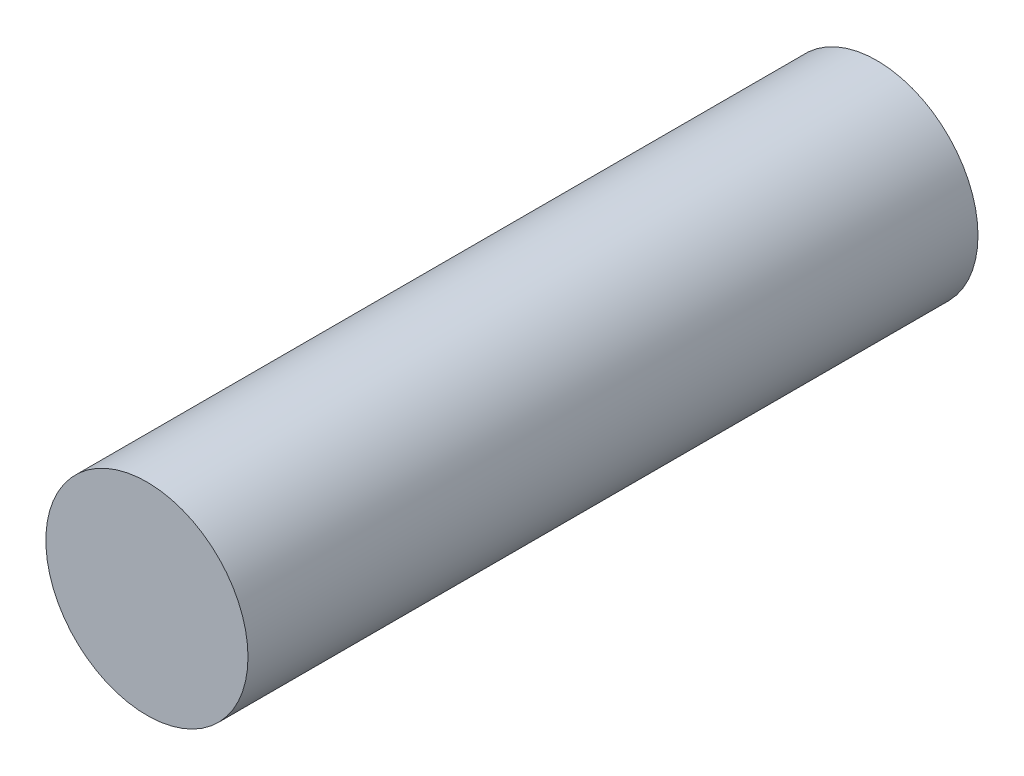
ISO-10303-21;
HEADER;
FILE_DESCRIPTION(('STEP AP214'),'2;1');
FILE_NAME('part.step','',(''),(''),'','','');
FILE_SCHEMA(('AUTOMOTIVE_DESIGN { 1 0 10303 214 1 1 1 1 }'));
ENDSEC;
DATA;
#1=APPLICATION_CONTEXT('core data for automotive mechanical design processes');
#2=APPLICATION_PROTOCOL_DEFINITION('international standard','automotive_design',2000,#1);
#3=PRODUCT_CONTEXT('',#1,'mechanical');
#4=PRODUCT('Part','Part','',(#3));
#5=PRODUCT_RELATED_PRODUCT_CATEGORY('part','',(#4));
#6=PRODUCT_DEFINITION_FORMATION('','',#4);
#7=PRODUCT_DEFINITION_CONTEXT('part definition',#1,'design');
#8=PRODUCT_DEFINITION('design','',#6,#7);
#9=PRODUCT_DEFINITION_SHAPE('','',#8);
#10=(LENGTH_UNIT() NAMED_UNIT(*) SI_UNIT(.MILLI.,.METRE.));
#11=(NAMED_UNIT(*) PLANE_ANGLE_UNIT() SI_UNIT($,.RADIAN.));
#12=(NAMED_UNIT(*) SI_UNIT($,.STERADIAN.) SOLID_ANGLE_UNIT());
#13=UNCERTAINTY_MEASURE_WITH_UNIT(LENGTH_MEASURE(1.E-05),#10,'distance_accuracy_value','');
#14=(GEOMETRIC_REPRESENTATION_CONTEXT(3) GLOBAL_UNCERTAINTY_ASSIGNED_CONTEXT((#13)) GLOBAL_UNIT_ASSIGNED_CONTEXT((#10,
#11,#12)) REPRESENTATION_CONTEXT('',''));
#15=CARTESIAN_POINT('',(0.,0.,0.));
#16=DIRECTION('',(0.,0.,1.));
#17=DIRECTION('',(1.,0.,0.));
#18=AXIS2_PLACEMENT_3D('',#15,#16,#17);
#19=CARTESIAN_POINT('',(0.,0.,65.));
#20=DIRECTION('',(0.,0.,-1.));
#21=DIRECTION('',(-1.,0.,0.));
#22=AXIS2_PLACEMENT_3D('',#19,#20,#21);
#23=CYLINDRICAL_SURFACE('',#22,9.);
#24=CARTESIAN_POINT('',(0.,0.,65.));
#25=DIRECTION('',(0.,0.,1.));
#26=DIRECTION('',(1.,0.,0.));
#27=AXIS2_PLACEMENT_3D('',#24,#25,#26);
#28=CIRCLE('',#27,9.);
#29=CARTESIAN_POINT('',(9.,0.,65.));
#30=VERTEX_POINT('',#29);
#31=EDGE_CURVE('E10',#30,#30,#28,.T.);
#32=ORIENTED_EDGE('',*,*,#31,.F.);
#33=EDGE_LOOP('',(#32));
#34=FACE_BOUND('',#33,.T.);
#35=CARTESIAN_POINT('',(0.,0.,0.));
#36=DIRECTION('',(0.,0.,1.));
#37=DIRECTION('',(1.,0.,0.));
#38=AXIS2_PLACEMENT_3D('',#35,#36,#37);
#39=CIRCLE('',#38,9.);
#40=CARTESIAN_POINT('',(9.,0.,0.));
#41=VERTEX_POINT('',#40);
#42=EDGE_CURVE('E36',#41,#41,#39,.T.);
#43=ORIENTED_EDGE('',*,*,#42,.T.);
#44=EDGE_LOOP('',(#43));
#45=FACE_BOUND('',#44,.T.);
#46=ADVANCED_FACE('F33',(#34,#45),#23,.T.);
#47=CARTESIAN_POINT('',(0.,0.,65.));
#48=DIRECTION('',(0.,0.,1.));
#49=DIRECTION('',(1.,0.,0.));
#50=AXIS2_PLACEMENT_3D('',#47,#48,#49);
#51=PLANE('',#50);
#52=ORIENTED_EDGE('',*,*,#31,.T.);
#53=EDGE_LOOP('',(#52));
#54=FACE_BOUND('',#53,.T.);
#55=ADVANCED_FACE('F48',(#54),#51,.T.);
#56=CARTESIAN_POINT('',(0.,0.,0.));
#57=DIRECTION('',(0.,0.,1.));
#58=DIRECTION('',(1.,0.,0.));
#59=AXIS2_PLACEMENT_3D('',#56,#57,#58);
#60=PLANE('',#59);
#61=ORIENTED_EDGE('',*,*,#42,.F.);
#62=EDGE_LOOP('',(#61));
#63=FACE_BOUND('',#62,.T.);
#64=ADVANCED_FACE('F46',(#63),#60,.F.);
#65=CLOSED_SHELL('',(#46,#55,#64));
#66=MANIFOLD_SOLID_BREP('B2',#65);
#67=ADVANCED_BREP_SHAPE_REPRESENTATION('',(#18,#66),#14);
#68=SHAPE_DEFINITION_REPRESENTATION(#9,#67);
ENDSEC;
END-ISO-10303-21;
